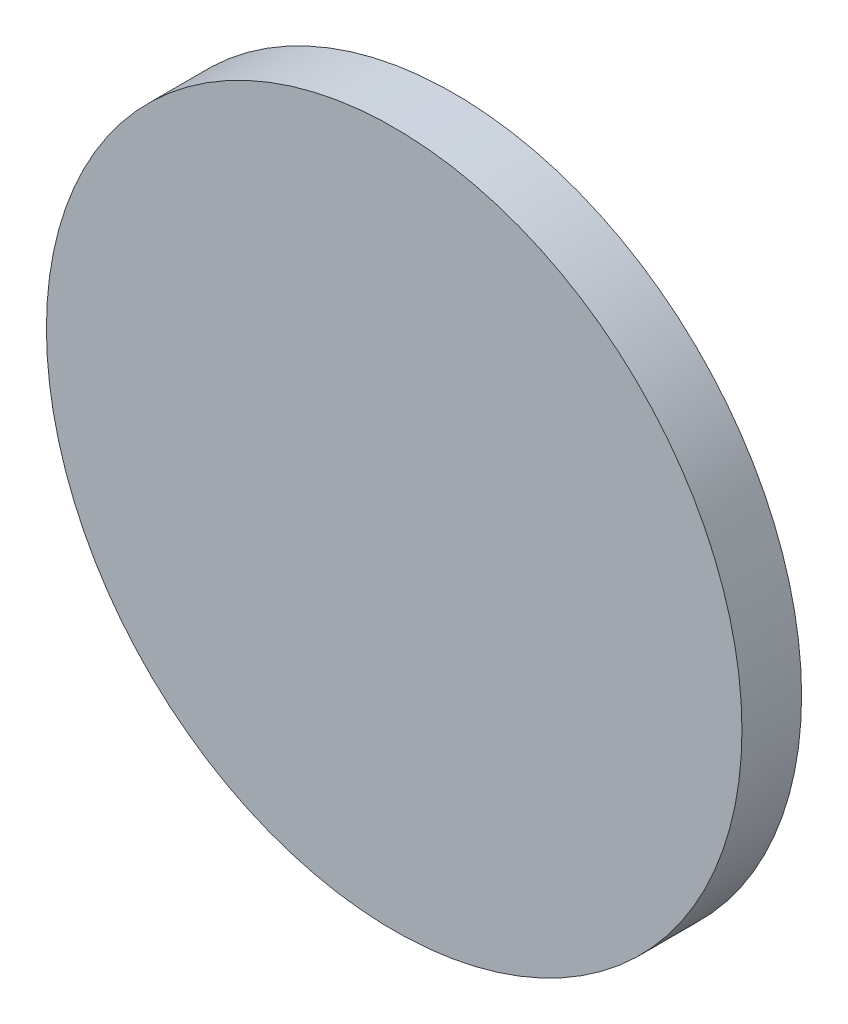
ISO-10303-21;
HEADER;
FILE_DESCRIPTION(('STEP AP214'),'2;1');
FILE_NAME('part.step','',(''),(''),'','','');
FILE_SCHEMA(('AUTOMOTIVE_DESIGN { 1 0 10303 214 1 1 1 1 }'));
ENDSEC;
DATA;
#1=APPLICATION_CONTEXT('core data for automotive mechanical design processes');
#2=APPLICATION_PROTOCOL_DEFINITION('international standard','automotive_design',2000,#1);
#3=PRODUCT_CONTEXT('',#1,'mechanical');
#4=PRODUCT('Part','Part','',(#3));
#5=PRODUCT_RELATED_PRODUCT_CATEGORY('part','',(#4));
#6=PRODUCT_DEFINITION_FORMATION('','',#4);
#7=PRODUCT_DEFINITION_CONTEXT('part definition',#1,'design');
#8=PRODUCT_DEFINITION('design','',#6,#7);
#9=PRODUCT_DEFINITION_SHAPE('','',#8);
#10=(LENGTH_UNIT() NAMED_UNIT(*) SI_UNIT(.MILLI.,.METRE.));
#11=(NAMED_UNIT(*) PLANE_ANGLE_UNIT() SI_UNIT($,.RADIAN.));
#12=(NAMED_UNIT(*) SI_UNIT($,.STERADIAN.) SOLID_ANGLE_UNIT());
#13=UNCERTAINTY_MEASURE_WITH_UNIT(LENGTH_MEASURE(1.E-05),#10,'distance_accuracy_value','');
#14=(GEOMETRIC_REPRESENTATION_CONTEXT(3) GLOBAL_UNCERTAINTY_ASSIGNED_CONTEXT((#13)) GLOBAL_UNIT_ASSIGNED_CONTEXT((#10,
#11,#12)) REPRESENTATION_CONTEXT('',''));
#15=CARTESIAN_POINT('',(0.,0.,0.));
#16=DIRECTION('',(0.,0.,1.));
#17=DIRECTION('',(1.,0.,0.));
#18=AXIS2_PLACEMENT_3D('',#15,#16,#17);
#19=CARTESIAN_POINT('',(3.81254,2.146300006176,0.79916));
#20=DIRECTION('',(0.,0.,1.));
#21=DIRECTION('',(1.,0.,0.));
#22=AXIS2_PLACEMENT_3D('',#19,#20,#21);
#23=PLANE('',#22);
#24=CARTESIAN_POINT('',(3.81254,2.146300006176,0.79916));
#25=DIRECTION('',(0.,0.,1.));
#26=DIRECTION('',(1.,0.,0.));
#27=AXIS2_PLACEMENT_3D('',#24,#25,#26);
#28=CIRCLE('',#27,0.200024667);
#29=CARTESIAN_POINT('',(4.012564667,2.146300006176,0.79916));
#30=VERTEX_POINT('',#29);
#31=EDGE_CURVE('E18',#30,#30,#28,.F.);
#32=ORIENTED_EDGE('',*,*,#31,.F.);
#33=EDGE_LOOP('',(#32));
#34=FACE_BOUND('',#33,.T.);
#35=ADVANCED_FACE('F15',(#34),#23,.T.);
#36=CARTESIAN_POINT('',(3.81254,2.146300006176,0.76487));
#37=DIRECTION('',(0.,0.,1.));
#38=DIRECTION('',(1.,0.,0.));
#39=AXIS2_PLACEMENT_3D('',#36,#37,#38);
#40=CYLINDRICAL_SURFACE('',#39,0.200024667);
#41=ORIENTED_EDGE('',*,*,#31,.T.);
#42=EDGE_LOOP('',(#41));
#43=FACE_BOUND('',#42,.T.);
#44=CARTESIAN_POINT('',(3.81254,2.146300006176,0.76487));
#45=DIRECTION('',(0.,0.,1.));
#46=DIRECTION('',(1.,0.,0.));
#47=AXIS2_PLACEMENT_3D('',#44,#45,#46);
#48=CIRCLE('',#47,0.200024667);
#49=CARTESIAN_POINT('',(4.012564667,2.146300006176,0.76487));
#50=VERTEX_POINT('',#49);
#51=EDGE_CURVE('E10',#50,#50,#48,.F.);
#52=ORIENTED_EDGE('',*,*,#51,.F.);
#53=EDGE_LOOP('',(#52));
#54=FACE_BOUND('',#53,.T.);
#55=ADVANCED_FACE('F27',(#43,#54),#40,.T.);
#56=CARTESIAN_POINT('',(3.81254,2.146300006176,0.76487));
#57=DIRECTION('',(0.,0.,-1.));
#58=DIRECTION('',(-1.,0.,0.));
#59=AXIS2_PLACEMENT_3D('',#56,#57,#58);
#60=PLANE('',#59);
#61=ORIENTED_EDGE('',*,*,#51,.T.);
#62=EDGE_LOOP('',(#61));
#63=FACE_BOUND('',#62,.T.);
#64=ADVANCED_FACE('F35',(#63),#60,.T.);
#65=CLOSED_SHELL('',(#35,#55,#64));
#66=MANIFOLD_SOLID_BREP('B1',#65);
#67=ADVANCED_BREP_SHAPE_REPRESENTATION('',(#18,#66),#14);
#68=SHAPE_DEFINITION_REPRESENTATION(#9,#67);
ENDSEC;
END-ISO-10303-21;
